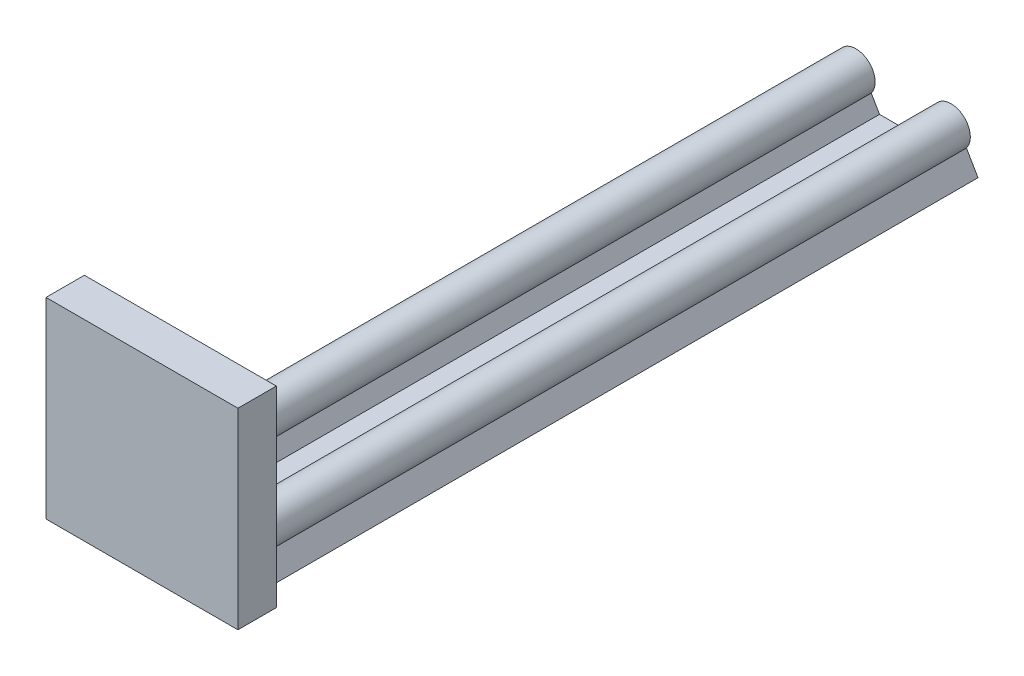
ISO-10303-21;
HEADER;
FILE_DESCRIPTION(('STEP AP214'),'2;1');
FILE_NAME('part.step','',(''),(''),'','','');
FILE_SCHEMA(('AUTOMOTIVE_DESIGN { 1 0 10303 214 1 1 1 1 }'));
ENDSEC;
DATA;
#1=APPLICATION_CONTEXT('core data for automotive mechanical design processes');
#2=APPLICATION_PROTOCOL_DEFINITION('international standard','automotive_design',2000,#1);
#3=PRODUCT_CONTEXT('',#1,'mechanical');
#4=PRODUCT('Part','Part','',(#3));
#5=PRODUCT_RELATED_PRODUCT_CATEGORY('part','',(#4));
#6=PRODUCT_DEFINITION_FORMATION('','',#4);
#7=PRODUCT_DEFINITION_CONTEXT('part definition',#1,'design');
#8=PRODUCT_DEFINITION('design','',#6,#7);
#9=PRODUCT_DEFINITION_SHAPE('','',#8);
#10=(LENGTH_UNIT() NAMED_UNIT(*) SI_UNIT(.MILLI.,.METRE.));
#11=(NAMED_UNIT(*) PLANE_ANGLE_UNIT() SI_UNIT($,.RADIAN.));
#12=(NAMED_UNIT(*) SI_UNIT($,.STERADIAN.) SOLID_ANGLE_UNIT());
#13=UNCERTAINTY_MEASURE_WITH_UNIT(LENGTH_MEASURE(1.E-05),#10,'distance_accuracy_value','');
#14=(GEOMETRIC_REPRESENTATION_CONTEXT(3) GLOBAL_UNCERTAINTY_ASSIGNED_CONTEXT((#13)) GLOBAL_UNIT_ASSIGNED_CONTEXT((#10,
#11,#12)) REPRESENTATION_CONTEXT('',''));
#15=CARTESIAN_POINT('',(0.,0.,0.));
#16=DIRECTION('',(0.,0.,1.));
#17=DIRECTION('',(1.,0.,0.));
#18=AXIS2_PLACEMENT_3D('',#15,#16,#17);
#19=CARTESIAN_POINT('',(0.,0.,220.));
#20=DIRECTION('',(0.,0.,-1.));
#21=DIRECTION('',(-1.,0.,0.));
#22=AXIS2_PLACEMENT_3D('',#19,#20,#21);
#23=CYLINDRICAL_SURFACE('',#22,5.);
#24=CARTESIAN_POINT('',(0.,0.,199.2));
#25=DIRECTION('',(0.,0.,1.));
#26=DIRECTION('',(1.,0.,0.));
#27=AXIS2_PLACEMENT_3D('',#24,#25,#26);
#28=CIRCLE('',#27,5.);
#29=CARTESIAN_POINT('',(4.,-3.,199.2));
#30=VERTEX_POINT('',#29);
#31=CARTESIAN_POINT('',(-4.,-3.,199.2));
#32=VERTEX_POINT('',#31);
#33=EDGE_CURVE('E195',#30,#32,#28,.T.);
#34=ORIENTED_EDGE('',*,*,#33,.F.);
#35=DIRECTION('',(0.,0.,-1.));
#36=VECTOR('',#35,1.);
#37=CARTESIAN_POINT('',(4.,-3.,220.));
#38=LINE('',#37,#36);
#39=CARTESIAN_POINT('',(4.,-3.,10.8));
#40=VERTEX_POINT('',#39);
#41=EDGE_CURVE('E239',#30,#40,#38,.T.);
#42=ORIENTED_EDGE('',*,*,#41,.T.);
#43=CARTESIAN_POINT('',(0.,0.,10.8));
#44=DIRECTION('',(0.,0.,-1.));
#45=DIRECTION('',(-1.,0.,0.));
#46=AXIS2_PLACEMENT_3D('',#43,#44,#45);
#47=CIRCLE('',#46,5.);
#48=CARTESIAN_POINT('',(-4.,-3.,10.8));
#49=VERTEX_POINT('',#48);
#50=EDGE_CURVE('E222',#49,#40,#47,.T.);
#51=ORIENTED_EDGE('',*,*,#50,.F.);
#52=DIRECTION('',(0.,0.,-1.));
#53=VECTOR('',#52,1.);
#54=CARTESIAN_POINT('',(-4.,-3.,220.));
#55=LINE('',#54,#53);
#56=EDGE_CURVE('E52',#32,#49,#55,.T.);
#57=ORIENTED_EDGE('',*,*,#56,.F.);
#58=EDGE_LOOP('',(#34,#42,#51,#57));
#59=FACE_BOUND('',#58,.T.);
#60=ADVANCED_FACE('F45',(#59),#23,.T.);
#61=CARTESIAN_POINT('',(-1.70096189432334,0.982050807568877,220.));
#62=DIRECTION('',(0.866025403784438,-0.5,0.));
#63=DIRECTION('',(0.5,0.866025403784439,0.));
#64=AXIS2_PLACEMENT_3D('',#61,#62,#63);
#65=PLANE('',#64);
#66=DIRECTION('',(-0.5,-0.866025403784439,0.));
#67=VECTOR('',#66,1.);
#68=CARTESIAN_POINT('',(-1.70096189432334,0.982050807568877,199.2));
#69=LINE('',#68,#67);
#70=CARTESIAN_POINT('',(-7.,-8.19615242270664,199.2));
#71=VERTEX_POINT('',#70);
#72=EDGE_CURVE('E158',#32,#71,#69,.T.);
#73=ORIENTED_EDGE('',*,*,#72,.F.);
#74=ORIENTED_EDGE('',*,*,#56,.T.);
#75=DIRECTION('',(0.5,0.866025403784439,0.));
#76=VECTOR('',#75,1.);
#77=CARTESIAN_POINT('',(-7.,-8.19615242270663,10.8));
#78=LINE('',#77,#76);
#79=CARTESIAN_POINT('',(-7.,-8.19615242270663,10.8));
#80=VERTEX_POINT('',#79);
#81=EDGE_CURVE('E219',#80,#49,#78,.T.);
#82=ORIENTED_EDGE('',*,*,#81,.F.);
#83=DIRECTION('',(0.,0.,-1.));
#84=VECTOR('',#83,1.);
#85=CARTESIAN_POINT('',(-7.,-8.19615242270663,220.));
#86=LINE('',#85,#84);
#87=EDGE_CURVE('E243',#71,#80,#86,.T.);
#88=ORIENTED_EDGE('',*,*,#87,.F.);
#89=EDGE_LOOP('',(#73,#74,#82,#88));
#90=FACE_BOUND('',#89,.T.);
#91=ADVANCED_FACE('F247',(#90),#65,.F.);
#92=CARTESIAN_POINT('',(1.70096189432334,0.982050807568877,220.));
#93=DIRECTION('',(0.866025403784438,0.5,0.));
#94=DIRECTION('',(-0.5,0.866025403784439,0.));
#95=AXIS2_PLACEMENT_3D('',#92,#93,#94);
#96=PLANE('',#95);
#97=ORIENTED_EDGE('',*,*,#41,.F.);
#98=DIRECTION('',(0.5,-0.866025403784439,0.));
#99=VECTOR('',#98,1.);
#100=CARTESIAN_POINT('',(1.70096189432334,0.982050807568877,199.2));
#101=LINE('',#100,#99);
#102=CARTESIAN_POINT('',(6.15,-6.72390923627308,199.2));
#103=VERTEX_POINT('',#102);
#104=EDGE_CURVE('E192',#30,#103,#101,.T.);
#105=ORIENTED_EDGE('',*,*,#104,.T.);
#106=DIRECTION('',(0.,0.,1.));
#107=VECTOR('',#106,1.);
#108=CARTESIAN_POINT('',(6.15,-6.72390923627308,0.));
#109=LINE('',#108,#107);
#110=CARTESIAN_POINT('',(6.15,-6.72390923627308,10.8));
#111=VERTEX_POINT('',#110);
#112=EDGE_CURVE('E236',#111,#103,#109,.T.);
#113=ORIENTED_EDGE('',*,*,#112,.F.);
#114=DIRECTION('',(0.5,-0.866025403784439,0.));
#115=VECTOR('',#114,1.);
#116=CARTESIAN_POINT('',(4.,-3.,10.8));
#117=LINE('',#116,#115);
#118=EDGE_CURVE('E225',#40,#111,#117,.T.);
#119=ORIENTED_EDGE('',*,*,#118,.F.);
#120=EDGE_LOOP('',(#97,#105,#113,#119));
#121=FACE_BOUND('',#120,.T.);
#122=ADVANCED_FACE('F257',(#121),#96,.T.);
#123=CARTESIAN_POINT('',(6.15,-6.72390923627308,0.));
#124=DIRECTION('',(0.,1.,0.));
#125=DIRECTION('',(-1.,0.,0.));
#126=AXIS2_PLACEMENT_3D('',#123,#124,#125);
#127=PLANE('',#126);
#128=ORIENTED_EDGE('',*,*,#112,.T.);
#129=DIRECTION('',(1.,0.,0.));
#130=VECTOR('',#129,1.);
#131=CARTESIAN_POINT('',(6.15,-6.72390923627308,199.2));
#132=LINE('',#131,#130);
#133=CARTESIAN_POINT('',(18.65,-6.72390923627309,199.2));
#134=VERTEX_POINT('',#133);
#135=EDGE_CURVE('E189',#103,#134,#132,.T.);
#136=ORIENTED_EDGE('',*,*,#135,.T.);
#137=DIRECTION('',(0.,0.,1.));
#138=VECTOR('',#137,1.);
#139=CARTESIAN_POINT('',(18.65,-6.72390923627309,0.));
#140=LINE('',#139,#138);
#141=CARTESIAN_POINT('',(18.65,-6.72390923627309,10.8));
#142=VERTEX_POINT('',#141);
#143=EDGE_CURVE('E232',#142,#134,#140,.T.);
#144=ORIENTED_EDGE('',*,*,#143,.F.);
#145=DIRECTION('',(1.,0.,0.));
#146=VECTOR('',#145,1.);
#147=CARTESIAN_POINT('',(6.15,-6.72390923627308,10.8));
#148=LINE('',#147,#146);
#149=EDGE_CURVE('E227',#111,#142,#148,.T.);
#150=ORIENTED_EDGE('',*,*,#149,.F.);
#151=EDGE_LOOP('',(#128,#136,#144,#150));
#152=FACE_BOUND('',#151,.T.);
#153=ADVANCED_FACE('F262',(#152),#127,.T.);
#154=CARTESIAN_POINT('',(24.8,0.,220.));
#155=DIRECTION('',(0.,0.,-1.));
#156=DIRECTION('',(-1.,0.,0.));
#157=AXIS2_PLACEMENT_3D('',#154,#155,#156);
#158=CYLINDRICAL_SURFACE('',#157,5.);
#159=DIRECTION('',(0.,0.,-1.));
#160=VECTOR('',#159,1.);
#161=CARTESIAN_POINT('',(20.8,-3.,220.));
#162=LINE('',#161,#160);
#163=CARTESIAN_POINT('',(20.8,-3.,199.2));
#164=VERTEX_POINT('',#163);
#165=CARTESIAN_POINT('',(20.8,-3.,10.8));
#166=VERTEX_POINT('',#165);
#167=EDGE_CURVE('E67',#164,#166,#162,.T.);
#168=ORIENTED_EDGE('',*,*,#167,.F.);
#169=CARTESIAN_POINT('',(24.8,0.,199.2));
#170=DIRECTION('',(0.,0.,1.));
#171=DIRECTION('',(1.,0.,0.));
#172=AXIS2_PLACEMENT_3D('',#169,#170,#171);
#173=CIRCLE('',#172,5.);
#174=CARTESIAN_POINT('',(28.8,-3.,199.2));
#175=VERTEX_POINT('',#174);
#176=EDGE_CURVE('E182',#164,#175,#173,.F.);
#177=ORIENTED_EDGE('',*,*,#176,.T.);
#178=DIRECTION('',(0.,0.,-1.));
#179=VECTOR('',#178,1.);
#180=CARTESIAN_POINT('',(28.8,-3.,220.));
#181=LINE('',#180,#179);
#182=CARTESIAN_POINT('',(28.8,-3.,10.8));
#183=VERTEX_POINT('',#182);
#184=EDGE_CURVE('E59',#175,#183,#181,.T.);
#185=ORIENTED_EDGE('',*,*,#184,.T.);
#186=CARTESIAN_POINT('',(24.8,0.,10.8));
#187=DIRECTION('',(0.,0.,-1.));
#188=DIRECTION('',(-1.,0.,0.));
#189=AXIS2_PLACEMENT_3D('',#186,#187,#188);
#190=CIRCLE('',#189,5.);
#191=EDGE_CURVE('E211',#166,#183,#190,.T.);
#192=ORIENTED_EDGE('',*,*,#191,.F.);
#193=EDGE_LOOP('',(#168,#177,#185,#192));
#194=FACE_BOUND('',#193,.T.);
#195=ADVANCED_FACE('F265',(#194),#158,.T.);
#196=CARTESIAN_POINT('',(20.8,-3.,220.));
#197=DIRECTION('',(0.866025403784439,-0.5,0.));
#198=DIRECTION('',(0.5,0.866025403784439,0.));
#199=AXIS2_PLACEMENT_3D('',#196,#197,#198);
#200=PLANE('',#199);
#201=DIRECTION('',(-0.5,-0.866025403784439,0.));
#202=VECTOR('',#201,1.);
#203=CARTESIAN_POINT('',(20.8,-3.,199.2));
#204=LINE('',#203,#202);
#205=EDGE_CURVE('E187',#164,#134,#204,.T.);
#206=ORIENTED_EDGE('',*,*,#205,.F.);
#207=ORIENTED_EDGE('',*,*,#167,.T.);
#208=DIRECTION('',(0.5,0.866025403784439,0.));
#209=VECTOR('',#208,1.);
#210=CARTESIAN_POINT('',(18.65,-6.72390923627309,10.8));
#211=LINE('',#210,#209);
#212=EDGE_CURVE('E229',#142,#166,#211,.T.);
#213=ORIENTED_EDGE('',*,*,#212,.F.);
#214=ORIENTED_EDGE('',*,*,#143,.T.);
#215=EDGE_LOOP('',(#206,#207,#213,#214));
#216=FACE_BOUND('',#215,.T.);
#217=ADVANCED_FACE('F263',(#216),#200,.F.);
#218=CARTESIAN_POINT('',(28.8,-3.,220.));
#219=DIRECTION('',(0.866025403784438,0.5,0.));
#220=DIRECTION('',(-0.5,0.866025403784438,0.));
#221=AXIS2_PLACEMENT_3D('',#218,#219,#220);
#222=PLANE('',#221);
#223=ORIENTED_EDGE('',*,*,#184,.F.);
#224=DIRECTION('',(0.5,-0.866025403784438,0.));
#225=VECTOR('',#224,1.);
#226=CARTESIAN_POINT('',(28.8,-3.,199.2));
#227=LINE('',#226,#225);
#228=CARTESIAN_POINT('',(31.8,-8.19615242270663,199.2));
#229=VERTEX_POINT('',#228);
#230=EDGE_CURVE('E11',#175,#229,#227,.T.);
#231=ORIENTED_EDGE('',*,*,#230,.T.);
#232=DIRECTION('',(0.,0.,-1.));
#233=VECTOR('',#232,1.);
#234=CARTESIAN_POINT('',(31.8,-8.19615242270663,220.));
#235=LINE('',#234,#233);
#236=CARTESIAN_POINT('',(31.8,-8.19615242270663,10.8));
#237=VERTEX_POINT('',#236);
#238=EDGE_CURVE('E233',#229,#237,#235,.T.);
#239=ORIENTED_EDGE('',*,*,#238,.T.);
#240=DIRECTION('',(0.5,-0.866025403784438,0.));
#241=VECTOR('',#240,1.);
#242=CARTESIAN_POINT('',(28.8,-3.,10.8));
#243=LINE('',#242,#241);
#244=EDGE_CURVE('E213',#183,#237,#243,.T.);
#245=ORIENTED_EDGE('',*,*,#244,.F.);
#246=EDGE_LOOP('',(#223,#231,#239,#245));
#247=FACE_BOUND('',#246,.T.);
#248=ADVANCED_FACE('F267',(#247),#222,.T.);
#249=CARTESIAN_POINT('',(0.,-8.19615242270663,220.));
#250=DIRECTION('',(0.,1.,0.));
#251=DIRECTION('',(0.,0.,1.));
#252=AXIS2_PLACEMENT_3D('',#249,#250,#251);
#253=PLANE('',#252);
#254=CARTESIAN_POINT('',(0.,-8.19615242270663,197.5));
#255=DIRECTION('',(0.,-1.,0.));
#256=DIRECTION('',(0.,0.,-1.));
#257=AXIS2_PLACEMENT_3D('',#254,#255,#256);
#258=CIRCLE('',#257,3.20000000000001);
#259=CARTESIAN_POINT('',(0.,-8.19615242270663,194.3));
#260=VERTEX_POINT('',#259);
#261=EDGE_CURVE('E523',#260,#260,#258,.T.);
#262=ORIENTED_EDGE('',*,*,#261,.F.);
#263=EDGE_LOOP('',(#262));
#264=FACE_BOUND('',#263,.T.);
#265=CARTESIAN_POINT('',(4.29197477208621E-12,-8.19615242270663,23.2));
#266=DIRECTION('',(0.,-1.,0.));
#267=DIRECTION('',(0.,0.,-1.));
#268=AXIS2_PLACEMENT_3D('',#265,#266,#267);
#269=CIRCLE('',#268,3.2);
#270=CARTESIAN_POINT('',(4.29197477208621E-12,-8.19615242270663,20.));
#271=VERTEX_POINT('',#270);
#272=EDGE_CURVE('E549',#271,#271,#269,.T.);
#273=ORIENTED_EDGE('',*,*,#272,.F.);
#274=EDGE_LOOP('',(#273));
#275=FACE_BOUND('',#274,.T.);
#276=CARTESIAN_POINT('',(24.8000000000043,-8.19615242270663,23.2000000000003));
#277=DIRECTION('',(0.,-1.,0.));
#278=DIRECTION('',(0.,0.,-1.));
#279=AXIS2_PLACEMENT_3D('',#276,#277,#278);
#280=CIRCLE('',#279,3.2);
#281=CARTESIAN_POINT('',(24.8000000000043,-8.19615242270663,20.0000000000003));
#282=VERTEX_POINT('',#281);
#283=EDGE_CURVE('E535',#282,#282,#280,.T.);
#284=ORIENTED_EDGE('',*,*,#283,.F.);
#285=EDGE_LOOP('',(#284));
#286=FACE_BOUND('',#285,.T.);
#287=CARTESIAN_POINT('',(24.8,-8.19615242270663,197.5));
#288=DIRECTION('',(0.,-1.,0.));
#289=DIRECTION('',(0.,0.,-1.));
#290=AXIS2_PLACEMENT_3D('',#287,#288,#289);
#291=CIRCLE('',#290,3.2);
#292=CARTESIAN_POINT('',(24.8,-8.19615242270663,194.3));
#293=VERTEX_POINT('',#292);
#294=EDGE_CURVE('E533',#293,#293,#291,.T.);
#295=ORIENTED_EDGE('',*,*,#294,.F.);
#296=EDGE_LOOP('',(#295));
#297=FACE_BOUND('',#296,.T.);
#298=DIRECTION('',(1.,0.,0.));
#299=VECTOR('',#298,1.);
#300=CARTESIAN_POINT('',(-7.,-8.19615242270663,209.2));
#301=LINE('',#300,#299);
#302=CARTESIAN_POINT('',(-12.6,-8.19615242270664,209.2));
#303=VERTEX_POINT('',#302);
#304=CARTESIAN_POINT('',(37.4,-8.19615242270663,209.2));
#305=VERTEX_POINT('',#304);
#306=EDGE_CURVE('E143',#303,#305,#301,.T.);
#307=ORIENTED_EDGE('',*,*,#306,.F.);
#308=DIRECTION('',(0.,0.,1.));
#309=VECTOR('',#308,1.);
#310=CARTESIAN_POINT('',(-12.6,-8.19615242270664,199.2));
#311=LINE('',#310,#309);
#312=CARTESIAN_POINT('',(-12.6,-8.19615242270664,199.2));
#313=VERTEX_POINT('',#312);
#314=EDGE_CURVE('E137',#313,#303,#311,.T.);
#315=ORIENTED_EDGE('',*,*,#314,.F.);
#316=DIRECTION('',(1.,0.,0.));
#317=VECTOR('',#316,1.);
#318=CARTESIAN_POINT('',(-12.6,-8.19615242270664,199.2));
#319=LINE('',#318,#317);
#320=EDGE_CURVE('E140',#313,#71,#319,.T.);
#321=ORIENTED_EDGE('',*,*,#320,.T.);
#322=ORIENTED_EDGE('',*,*,#87,.T.);
#323=DIRECTION('',(-1.,0.,0.));
#324=VECTOR('',#323,1.);
#325=CARTESIAN_POINT('',(31.8,-8.19615242270663,10.8));
#326=LINE('',#325,#324);
#327=EDGE_CURVE('E216',#237,#80,#326,.T.);
#328=ORIENTED_EDGE('',*,*,#327,.F.);
#329=ORIENTED_EDGE('',*,*,#238,.F.);
#330=CARTESIAN_POINT('',(37.4,-8.19615242270663,199.2));
#331=VERTEX_POINT('',#330);
#332=EDGE_CURVE('E160',#229,#331,#319,.T.);
#333=ORIENTED_EDGE('',*,*,#332,.T.);
#334=DIRECTION('',(0.,0.,1.));
#335=VECTOR('',#334,1.);
#336=CARTESIAN_POINT('',(37.4,-8.19615242270663,199.2));
#337=LINE('',#336,#335);
#338=EDGE_CURVE('E148',#331,#305,#337,.T.);
#339=ORIENTED_EDGE('',*,*,#338,.T.);
#340=EDGE_LOOP('',(#307,#315,#321,#322,#328,#329,#333,#339));
#341=FACE_BOUND('',#340,.T.);
#342=ADVANCED_FACE('F139',(#264,#275,#286,#297,#341),#253,.F.);
#343=CARTESIAN_POINT('',(24.8,0.,10.8));
#344=DIRECTION('',(0.,0.,-1.));
#345=DIRECTION('',(-1.,0.,0.));
#346=AXIS2_PLACEMENT_3D('',#343,#344,#345);
#347=PLANE('',#346);
#348=CARTESIAN_POINT('',(0.,0.,10.8));
#349=DIRECTION('',(0.,0.,-1.));
#350=DIRECTION('',(-1.,0.,0.));
#351=AXIS2_PLACEMENT_3D('',#348,#349,#350);
#352=CIRCLE('',#351,1.5);
#353=CARTESIAN_POINT('',(-1.5,0.,10.8));
#354=VERTEX_POINT('',#353);
#355=EDGE_CURVE('E202',#354,#354,#352,.T.);
#356=ORIENTED_EDGE('',*,*,#355,.F.);
#357=EDGE_LOOP('',(#356));
#358=FACE_BOUND('',#357,.T.);
#359=CARTESIAN_POINT('',(24.8,-1.73177474406619E-13,10.8));
#360=DIRECTION('',(0.,0.,-1.));
#361=DIRECTION('',(-1.,0.,0.));
#362=AXIS2_PLACEMENT_3D('',#359,#360,#361);
#363=CIRCLE('',#362,1.5);
#364=CARTESIAN_POINT('',(23.3,-1.73177474406619E-13,10.8));
#365=VERTEX_POINT('',#364);
#366=EDGE_CURVE('E205',#365,#365,#363,.T.);
#367=ORIENTED_EDGE('',*,*,#366,.F.);
#368=EDGE_LOOP('',(#367));
#369=FACE_BOUND('',#368,.T.);
#370=ORIENTED_EDGE('',*,*,#191,.T.);
#371=ORIENTED_EDGE('',*,*,#244,.T.);
#372=ORIENTED_EDGE('',*,*,#327,.T.);
#373=ORIENTED_EDGE('',*,*,#81,.T.);
#374=ORIENTED_EDGE('',*,*,#50,.T.);
#375=ORIENTED_EDGE('',*,*,#118,.T.);
#376=ORIENTED_EDGE('',*,*,#149,.T.);
#377=ORIENTED_EDGE('',*,*,#212,.T.);
#378=EDGE_LOOP('',(#370,#371,#372,#373,#374,#375,#376,#377));
#379=FACE_BOUND('',#378,.T.);
#380=ADVANCED_FACE('F252',(#358,#369,#379),#347,.T.);
#381=CARTESIAN_POINT('',(24.8,0.,209.2));
#382=DIRECTION('',(0.,0.,1.));
#383=DIRECTION('',(1.,0.,0.));
#384=AXIS2_PLACEMENT_3D('',#381,#382,#383);
#385=PLANE('',#384);
#386=DIRECTION('',(0.,-1.,0.));
#387=VECTOR('',#386,1.);
#388=CARTESIAN_POINT('',(-12.6,41.8038475772934,209.2));
#389=LINE('',#388,#387);
#390=CARTESIAN_POINT('',(-12.6,41.8038475772934,209.2));
#391=VERTEX_POINT('',#390);
#392=EDGE_CURVE('E176',#391,#303,#389,.T.);
#393=ORIENTED_EDGE('',*,*,#392,.T.);
#394=ORIENTED_EDGE('',*,*,#306,.T.);
#395=DIRECTION('',(0.,1.,0.));
#396=VECTOR('',#395,1.);
#397=CARTESIAN_POINT('',(37.4,41.8038475772934,209.2));
#398=LINE('',#397,#396);
#399=CARTESIAN_POINT('',(37.4,41.8038475772934,209.2));
#400=VERTEX_POINT('',#399);
#401=EDGE_CURVE('E167',#305,#400,#398,.T.);
#402=ORIENTED_EDGE('',*,*,#401,.T.);
#403=DIRECTION('',(-1.,0.,0.));
#404=VECTOR('',#403,1.);
#405=CARTESIAN_POINT('',(-12.6,41.8038475772934,209.2));
#406=LINE('',#405,#404);
#407=EDGE_CURVE('E164',#400,#391,#406,.T.);
#408=ORIENTED_EDGE('',*,*,#407,.T.);
#409=EDGE_LOOP('',(#393,#394,#402,#408));
#410=FACE_BOUND('',#409,.T.);
#411=ADVANCED_FACE('F278',(#410),#385,.T.);
#412=CARTESIAN_POINT('',(24.8,-1.73177474406619E-13,17.8));
#413=DIRECTION('',(0.,0.,-1.));
#414=DIRECTION('',(-1.,0.,0.));
#415=AXIS2_PLACEMENT_3D('',#412,#413,#414);
#416=CYLINDRICAL_SURFACE('',#415,1.5);
#417=CARTESIAN_POINT('',(24.8,-1.73177474406619E-13,17.8));
#418=DIRECTION('',(0.,0.,-1.));
#419=DIRECTION('',(-1.,0.,0.));
#420=AXIS2_PLACEMENT_3D('',#417,#418,#419);
#421=CIRCLE('',#420,1.5);
#422=CARTESIAN_POINT('',(23.3,-1.73177474406619E-13,17.8));
#423=VERTEX_POINT('',#422);
#424=EDGE_CURVE('E198',#423,#423,#421,.T.);
#425=ORIENTED_EDGE('',*,*,#424,.F.);
#426=EDGE_LOOP('',(#425));
#427=FACE_BOUND('',#426,.T.);
#428=ORIENTED_EDGE('',*,*,#366,.T.);
#429=EDGE_LOOP('',(#428));
#430=FACE_BOUND('',#429,.T.);
#431=ADVANCED_FACE('F280',(#427,#430),#416,.F.);
#432=CARTESIAN_POINT('',(24.8,-1.73177474406619E-13,17.8));
#433=DIRECTION('',(0.,0.,-1.));
#434=DIRECTION('',(-1.,0.,0.));
#435=AXIS2_PLACEMENT_3D('',#432,#433,#434);
#436=PLANE('',#435);
#437=ORIENTED_EDGE('',*,*,#424,.T.);
#438=EDGE_LOOP('',(#437));
#439=FACE_BOUND('',#438,.T.);
#440=ADVANCED_FACE('F287',(#439),#436,.T.);
#441=CARTESIAN_POINT('',(0.,0.,17.8));
#442=DIRECTION('',(0.,0.,-1.));
#443=DIRECTION('',(-1.,0.,0.));
#444=AXIS2_PLACEMENT_3D('',#441,#442,#443);
#445=CYLINDRICAL_SURFACE('',#444,1.5);
#446=CARTESIAN_POINT('',(0.,0.,17.8));
#447=DIRECTION('',(0.,0.,-1.));
#448=DIRECTION('',(-1.,0.,0.));
#449=AXIS2_PLACEMENT_3D('',#446,#447,#448);
#450=CIRCLE('',#449,1.5);
#451=CARTESIAN_POINT('',(-1.5,0.,17.8));
#452=VERTEX_POINT('',#451);
#453=EDGE_CURVE('E199',#452,#452,#450,.T.);
#454=ORIENTED_EDGE('',*,*,#453,.F.);
#455=EDGE_LOOP('',(#454));
#456=FACE_BOUND('',#455,.T.);
#457=ORIENTED_EDGE('',*,*,#355,.T.);
#458=EDGE_LOOP('',(#457));
#459=FACE_BOUND('',#458,.T.);
#460=ADVANCED_FACE('F338',(#456,#459),#445,.F.);
#461=CARTESIAN_POINT('',(0.,0.,17.8));
#462=DIRECTION('',(0.,0.,-1.));
#463=DIRECTION('',(-1.,0.,0.));
#464=AXIS2_PLACEMENT_3D('',#461,#462,#463);
#465=PLANE('',#464);
#466=ORIENTED_EDGE('',*,*,#453,.T.);
#467=EDGE_LOOP('',(#466));
#468=FACE_BOUND('',#467,.T.);
#469=ADVANCED_FACE('F334',(#468),#465,.T.);
#470=CARTESIAN_POINT('',(0.,0.,199.2));
#471=DIRECTION('',(0.,0.,1.));
#472=DIRECTION('',(1.,0.,0.));
#473=AXIS2_PLACEMENT_3D('',#470,#471,#472);
#474=PLANE('',#473);
#475=CARTESIAN_POINT('',(12.4,22.3038475772934,199.2));
#476=DIRECTION('',(0.,0.,-1.));
#477=DIRECTION('',(-1.,0.,0.));
#478=AXIS2_PLACEMENT_3D('',#475,#476,#477);
#479=CIRCLE('',#478,5.);
#480=CARTESIAN_POINT('',(7.4,22.3038475772934,199.2));
#481=VERTEX_POINT('',#480);
#482=EDGE_CURVE('E170',#481,#481,#479,.T.);
#483=ORIENTED_EDGE('',*,*,#482,.F.);
#484=EDGE_LOOP('',(#483));
#485=FACE_BOUND('',#484,.T.);
#486=ORIENTED_EDGE('',*,*,#33,.T.);
#487=ORIENTED_EDGE('',*,*,#72,.T.);
#488=ORIENTED_EDGE('',*,*,#320,.F.);
#489=DIRECTION('',(0.,-1.,0.));
#490=VECTOR('',#489,1.);
#491=CARTESIAN_POINT('',(-12.6,41.8038475772934,199.2));
#492=LINE('',#491,#490);
#493=CARTESIAN_POINT('',(-12.6,41.8038475772934,199.2));
#494=VERTEX_POINT('',#493);
#495=EDGE_CURVE('E155',#494,#313,#492,.T.);
#496=ORIENTED_EDGE('',*,*,#495,.F.);
#497=DIRECTION('',(-1.,0.,0.));
#498=VECTOR('',#497,1.);
#499=CARTESIAN_POINT('',(-12.6,41.8038475772934,199.2));
#500=LINE('',#499,#498);
#501=CARTESIAN_POINT('',(37.4,41.8038475772934,199.2));
#502=VERTEX_POINT('',#501);
#503=EDGE_CURVE('E149',#502,#494,#500,.T.);
#504=ORIENTED_EDGE('',*,*,#503,.F.);
#505=DIRECTION('',(0.,1.,0.));
#506=VECTOR('',#505,1.);
#507=CARTESIAN_POINT('',(37.4,41.8038475772934,199.2));
#508=LINE('',#507,#506);
#509=EDGE_CURVE('E159',#331,#502,#508,.T.);
#510=ORIENTED_EDGE('',*,*,#509,.F.);
#511=ORIENTED_EDGE('',*,*,#332,.F.);
#512=ORIENTED_EDGE('',*,*,#230,.F.);
#513=ORIENTED_EDGE('',*,*,#176,.F.);
#514=ORIENTED_EDGE('',*,*,#205,.T.);
#515=ORIENTED_EDGE('',*,*,#135,.F.);
#516=ORIENTED_EDGE('',*,*,#104,.F.);
#517=EDGE_LOOP('',(#486,#487,#488,#496,#504,#510,#511,#512,#513,#514,#515,#516));
#518=FACE_BOUND('',#517,.T.);
#519=ADVANCED_FACE('F153',(#485,#518),#474,.F.);
#520=CARTESIAN_POINT('',(-12.6,41.8038475772934,199.2));
#521=DIRECTION('',(-1.,0.,0.));
#522=DIRECTION('',(0.,-1.,0.));
#523=AXIS2_PLACEMENT_3D('',#520,#521,#522);
#524=PLANE('',#523);
#525=ORIENTED_EDGE('',*,*,#392,.F.);
#526=DIRECTION('',(0.,0.,1.));
#527=VECTOR('',#526,1.);
#528=CARTESIAN_POINT('',(-12.6,41.8038475772934,199.2));
#529=LINE('',#528,#527);
#530=EDGE_CURVE('E163',#494,#391,#529,.T.);
#531=ORIENTED_EDGE('',*,*,#530,.F.);
#532=ORIENTED_EDGE('',*,*,#495,.T.);
#533=ORIENTED_EDGE('',*,*,#314,.T.);
#534=EDGE_LOOP('',(#525,#531,#532,#533));
#535=FACE_BOUND('',#534,.T.);
#536=ADVANCED_FACE('F162',(#535),#524,.T.);
#537=CARTESIAN_POINT('',(-12.6,41.8038475772934,199.2));
#538=DIRECTION('',(0.,1.,0.));
#539=DIRECTION('',(0.,0.,1.));
#540=AXIS2_PLACEMENT_3D('',#537,#538,#539);
#541=PLANE('',#540);
#542=ORIENTED_EDGE('',*,*,#407,.F.);
#543=DIRECTION('',(0.,0.,1.));
#544=VECTOR('',#543,1.);
#545=CARTESIAN_POINT('',(37.4,41.8038475772934,199.2));
#546=LINE('',#545,#544);
#547=EDGE_CURVE('E183',#502,#400,#546,.T.);
#548=ORIENTED_EDGE('',*,*,#547,.F.);
#549=ORIENTED_EDGE('',*,*,#503,.T.);
#550=ORIENTED_EDGE('',*,*,#530,.T.);
#551=EDGE_LOOP('',(#542,#548,#549,#550));
#552=FACE_BOUND('',#551,.T.);
#553=ADVANCED_FACE('F276',(#552),#541,.T.);
#554=CARTESIAN_POINT('',(37.4,41.8038475772934,199.2));
#555=DIRECTION('',(1.,0.,0.));
#556=DIRECTION('',(0.,1.,0.));
#557=AXIS2_PLACEMENT_3D('',#554,#555,#556);
#558=PLANE('',#557);
#559=ORIENTED_EDGE('',*,*,#401,.F.);
#560=ORIENTED_EDGE('',*,*,#338,.F.);
#561=ORIENTED_EDGE('',*,*,#509,.T.);
#562=ORIENTED_EDGE('',*,*,#547,.T.);
#563=EDGE_LOOP('',(#559,#560,#561,#562));
#564=FACE_BOUND('',#563,.T.);
#565=ADVANCED_FACE('F273',(#564),#558,.T.);
#566=CARTESIAN_POINT('',(12.4,22.3038475772934,204.2));
#567=DIRECTION('',(0.,0.,-1.));
#568=DIRECTION('',(-1.,0.,0.));
#569=AXIS2_PLACEMENT_3D('',#566,#567,#568);
#570=CYLINDRICAL_SURFACE('',#569,5.);
#571=CARTESIAN_POINT('',(12.4,22.3038475772934,204.2));
#572=DIRECTION('',(0.,0.,-1.));
#573=DIRECTION('',(-1.,0.,0.));
#574=AXIS2_PLACEMENT_3D('',#571,#572,#573);
#575=CIRCLE('',#574,5.);
#576=CARTESIAN_POINT('',(7.4,22.3038475772934,204.2));
#577=VERTEX_POINT('',#576);
#578=EDGE_CURVE('E178',#577,#577,#575,.T.);
#579=ORIENTED_EDGE('',*,*,#578,.F.);
#580=EDGE_LOOP('',(#579));
#581=FACE_BOUND('',#580,.T.);
#582=ORIENTED_EDGE('',*,*,#482,.T.);
#583=EDGE_LOOP('',(#582));
#584=FACE_BOUND('',#583,.T.);
#585=ADVANCED_FACE('F422',(#581,#584),#570,.F.);
#586=CARTESIAN_POINT('',(12.4,22.3038475772934,204.2));
#587=DIRECTION('',(0.,0.,-1.));
#588=DIRECTION('',(-1.,0.,0.));
#589=AXIS2_PLACEMENT_3D('',#586,#587,#588);
#590=PLANE('',#589);
#591=ORIENTED_EDGE('',*,*,#578,.T.);
#592=EDGE_LOOP('',(#591));
#593=FACE_BOUND('',#592,.T.);
#594=ADVANCED_FACE('F430',(#593),#590,.T.);
#595=CARTESIAN_POINT('',(24.8,-3.19615242270663,197.5));
#596=DIRECTION('',(0.,-1.,0.));
#597=DIRECTION('',(0.,0.,-1.));
#598=AXIS2_PLACEMENT_3D('',#595,#596,#597);
#599=CYLINDRICAL_SURFACE('',#598,3.2);
#600=CARTESIAN_POINT('',(24.8,-3.19615242270663,197.5));
#601=DIRECTION('',(0.,-1.,0.));
#602=DIRECTION('',(0.,0.,-1.));
#603=AXIS2_PLACEMENT_3D('',#600,#601,#602);
#604=CIRCLE('',#603,3.2);
#605=CARTESIAN_POINT('',(24.8,-3.19615242270663,194.3));
#606=VERTEX_POINT('',#605);
#607=EDGE_CURVE('E530',#606,#606,#604,.T.);
#608=ORIENTED_EDGE('',*,*,#607,.F.);
#609=EDGE_LOOP('',(#608));
#610=FACE_BOUND('',#609,.T.);
#611=ORIENTED_EDGE('',*,*,#294,.T.);
#612=EDGE_LOOP('',(#611));
#613=FACE_BOUND('',#612,.T.);
#614=ADVANCED_FACE('F438',(#610,#613),#599,.F.);
#615=CARTESIAN_POINT('',(0.,-3.19615242270663,0.));
#616=DIRECTION('',(0.,-1.,0.));
#617=DIRECTION('',(0.,0.,-1.));
#618=AXIS2_PLACEMENT_3D('',#615,#616,#617);
#619=PLANE('',#618);
#620=ORIENTED_EDGE('',*,*,#607,.T.);
#621=EDGE_LOOP('',(#620));
#622=FACE_BOUND('',#621,.T.);
#623=ADVANCED_FACE('F446',(#622),#619,.T.);
#624=CARTESIAN_POINT('',(24.8000000000043,-3.19615242270663,23.2000000000003));
#625=DIRECTION('',(0.,-1.,0.));
#626=DIRECTION('',(0.,0.,-1.));
#627=AXIS2_PLACEMENT_3D('',#624,#625,#626);
#628=CYLINDRICAL_SURFACE('',#627,3.2);
#629=CARTESIAN_POINT('',(24.8000000000043,-3.19615242270663,23.2000000000003));
#630=DIRECTION('',(0.,-1.,0.));
#631=DIRECTION('',(0.,0.,-1.));
#632=AXIS2_PLACEMENT_3D('',#629,#630,#631);
#633=CIRCLE('',#632,3.2);
#634=CARTESIAN_POINT('',(24.8000000000043,-3.19615242270663,20.0000000000003));
#635=VERTEX_POINT('',#634);
#636=EDGE_CURVE('E544',#635,#635,#633,.T.);
#637=ORIENTED_EDGE('',*,*,#636,.F.);
#638=EDGE_LOOP('',(#637));
#639=FACE_BOUND('',#638,.T.);
#640=ORIENTED_EDGE('',*,*,#283,.T.);
#641=EDGE_LOOP('',(#640));
#642=FACE_BOUND('',#641,.T.);
#643=ADVANCED_FACE('F455',(#639,#642),#628,.F.);
#644=CARTESIAN_POINT('',(24.8000000000043,-3.19615242270663,23.2000000000003));
#645=DIRECTION('',(0.,-1.,0.));
#646=DIRECTION('',(0.,0.,-1.));
#647=AXIS2_PLACEMENT_3D('',#644,#645,#646);
#648=PLANE('',#647);
#649=ORIENTED_EDGE('',*,*,#636,.T.);
#650=EDGE_LOOP('',(#649));
#651=FACE_BOUND('',#650,.T.);
#652=ADVANCED_FACE('F464',(#651),#648,.T.);
#653=CARTESIAN_POINT('',(4.29197477208621E-12,-3.19615242270663,23.2));
#654=DIRECTION('',(0.,-1.,0.));
#655=DIRECTION('',(0.,0.,-1.));
#656=AXIS2_PLACEMENT_3D('',#653,#654,#655);
#657=CYLINDRICAL_SURFACE('',#656,3.2);
#658=CARTESIAN_POINT('',(4.29197477208621E-12,-3.19615242270663,23.2));
#659=DIRECTION('',(0.,-1.,0.));
#660=DIRECTION('',(0.,0.,-1.));
#661=AXIS2_PLACEMENT_3D('',#658,#659,#660);
#662=CIRCLE('',#661,3.2);
#663=CARTESIAN_POINT('',(4.29197477208621E-12,-3.19615242270663,20.));
#664=VERTEX_POINT('',#663);
#665=EDGE_CURVE('E526',#664,#664,#662,.T.);
#666=ORIENTED_EDGE('',*,*,#665,.F.);
#667=EDGE_LOOP('',(#666));
#668=FACE_BOUND('',#667,.T.);
#669=ORIENTED_EDGE('',*,*,#272,.T.);
#670=EDGE_LOOP('',(#669));
#671=FACE_BOUND('',#670,.T.);
#672=ADVANCED_FACE('F473',(#668,#671),#657,.F.);
#673=CARTESIAN_POINT('',(4.29197477208621E-12,-3.19615242270663,23.2));
#674=DIRECTION('',(0.,-1.,0.));
#675=DIRECTION('',(0.,0.,-1.));
#676=AXIS2_PLACEMENT_3D('',#673,#674,#675);
#677=PLANE('',#676);
#678=ORIENTED_EDGE('',*,*,#665,.T.);
#679=EDGE_LOOP('',(#678));
#680=FACE_BOUND('',#679,.T.);
#681=ADVANCED_FACE('F482',(#680),#677,.T.);
#682=CARTESIAN_POINT('',(0.,-3.19615242270663,197.5));
#683=DIRECTION('',(0.,-1.,0.));
#684=DIRECTION('',(0.,0.,-1.));
#685=AXIS2_PLACEMENT_3D('',#682,#683,#684);
#686=CYLINDRICAL_SURFACE('',#685,3.20000000000001);
#687=CARTESIAN_POINT('',(0.,-3.19615242270663,197.5));
#688=DIRECTION('',(0.,-1.,0.));
#689=DIRECTION('',(0.,0.,-1.));
#690=AXIS2_PLACEMENT_3D('',#687,#688,#689);
#691=CIRCLE('',#690,3.20000000000001);
#692=CARTESIAN_POINT('',(0.,-3.19615242270663,194.3));
#693=VERTEX_POINT('',#692);
#694=EDGE_CURVE('E522',#693,#693,#691,.T.);
#695=ORIENTED_EDGE('',*,*,#694,.F.);
#696=EDGE_LOOP('',(#695));
#697=FACE_BOUND('',#696,.T.);
#698=ORIENTED_EDGE('',*,*,#261,.T.);
#699=EDGE_LOOP('',(#698));
#700=FACE_BOUND('',#699,.T.);
#701=ADVANCED_FACE('F491',(#697,#700),#686,.F.);
#702=CARTESIAN_POINT('',(0.,-3.19615242270663,197.5));
#703=DIRECTION('',(0.,-1.,0.));
#704=DIRECTION('',(0.,0.,-1.));
#705=AXIS2_PLACEMENT_3D('',#702,#703,#704);
#706=PLANE('',#705);
#707=ORIENTED_EDGE('',*,*,#694,.T.);
#708=EDGE_LOOP('',(#707));
#709=FACE_BOUND('',#708,.T.);
#710=ADVANCED_FACE('F500',(#709),#706,.T.);
#711=CLOSED_SHELL('',(#60,#91,#122,#153,#195,#217,#248,#342,#380,#411,#431,#440,#460,#469,#519,
#536,#553,#565,#585,#594,#614,#623,#643,#652,#672,#681,#701,#710));
#712=MANIFOLD_SOLID_BREP('B2',#711);
#713=ADVANCED_BREP_SHAPE_REPRESENTATION('',(#18,#712),#14);
#714=SHAPE_DEFINITION_REPRESENTATION(#9,#713);
ENDSEC;
END-ISO-10303-21;
